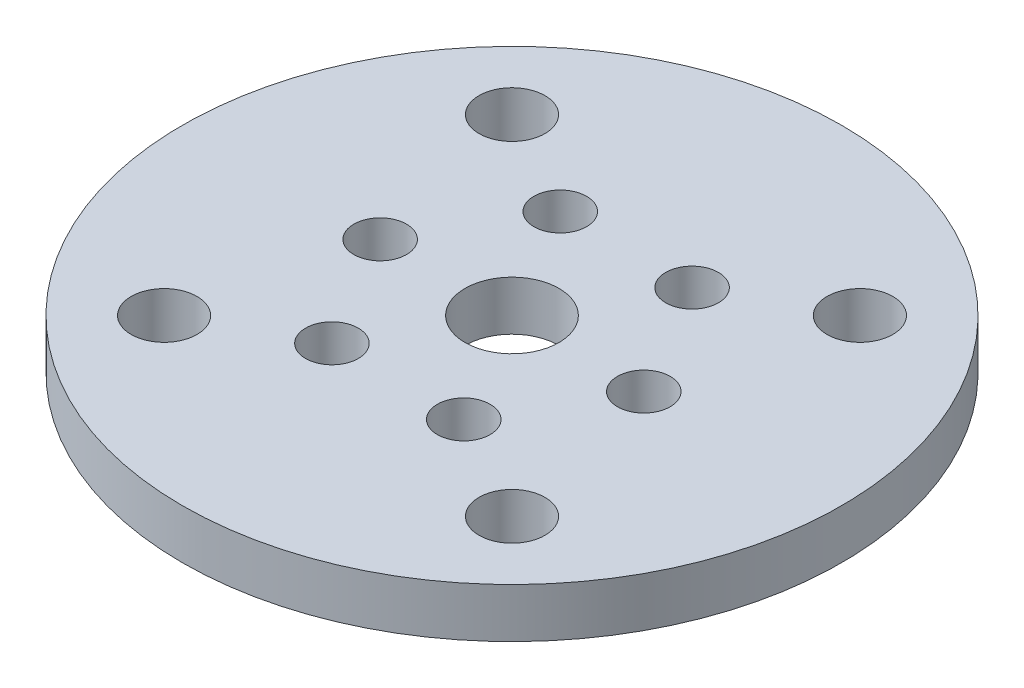
ISO-10303-21;
HEADER;
FILE_DESCRIPTION(('STEP AP214'),'2;1');
FILE_NAME('part.step','',(''),(''),'','','');
FILE_SCHEMA(('AUTOMOTIVE_DESIGN { 1 0 10303 214 1 1 1 1 }'));
ENDSEC;
DATA;
#1=APPLICATION_CONTEXT('core data for automotive mechanical design processes');
#2=APPLICATION_PROTOCOL_DEFINITION('international standard','automotive_design',2000,#1);
#3=PRODUCT_CONTEXT('',#1,'mechanical');
#4=PRODUCT('Part','Part','',(#3));
#5=PRODUCT_RELATED_PRODUCT_CATEGORY('part','',(#4));
#6=PRODUCT_DEFINITION_FORMATION('','',#4);
#7=PRODUCT_DEFINITION_CONTEXT('part definition',#1,'design');
#8=PRODUCT_DEFINITION('design','',#6,#7);
#9=PRODUCT_DEFINITION_SHAPE('','',#8);
#10=(LENGTH_UNIT() NAMED_UNIT(*) SI_UNIT(.MILLI.,.METRE.));
#11=(NAMED_UNIT(*) PLANE_ANGLE_UNIT() SI_UNIT($,.RADIAN.));
#12=(NAMED_UNIT(*) SI_UNIT($,.STERADIAN.) SOLID_ANGLE_UNIT());
#13=UNCERTAINTY_MEASURE_WITH_UNIT(LENGTH_MEASURE(1.E-05),#10,'distance_accuracy_value','');
#14=(GEOMETRIC_REPRESENTATION_CONTEXT(3) GLOBAL_UNCERTAINTY_ASSIGNED_CONTEXT((#13)) GLOBAL_UNIT_ASSIGNED_CONTEXT((#10,
#11,#12)) REPRESENTATION_CONTEXT('',''));
#15=CARTESIAN_POINT('',(0.,0.,0.));
#16=DIRECTION('',(0.,0.,1.));
#17=DIRECTION('',(1.,0.,0.));
#18=AXIS2_PLACEMENT_3D('',#15,#16,#17);
#19=CARTESIAN_POINT('',(0.,0.,0.));
#20=DIRECTION('',(0.,-1.,0.));
#21=DIRECTION('',(0.,0.,-1.));
#22=AXIS2_PLACEMENT_3D('',#19,#20,#21);
#23=CYLINDRICAL_SURFACE('',#22,20.);
#24=CARTESIAN_POINT('',(0.,0.,0.));
#25=DIRECTION('',(0.,-1.,0.));
#26=DIRECTION('',(0.,0.,1.));
#27=AXIS2_PLACEMENT_3D('',#24,#25,#26);
#28=CIRCLE('',#27,20.);
#29=CARTESIAN_POINT('',(0.,0.,20.));
#30=VERTEX_POINT('',#29);
#31=EDGE_CURVE('E10',#30,#30,#28,.T.);
#32=ORIENTED_EDGE('',*,*,#31,.T.);
#33=EDGE_LOOP('',(#32));
#34=FACE_BOUND('',#33,.T.);
#35=CARTESIAN_POINT('',(0.,-3.,0.));
#36=DIRECTION('',(0.,-1.,0.));
#37=DIRECTION('',(0.,0.,1.));
#38=AXIS2_PLACEMENT_3D('',#35,#36,#37);
#39=CIRCLE('',#38,20.);
#40=CARTESIAN_POINT('',(0.,-3.,20.));
#41=VERTEX_POINT('',#40);
#42=EDGE_CURVE('E33',#41,#41,#39,.T.);
#43=ORIENTED_EDGE('',*,*,#42,.F.);
#44=EDGE_LOOP('',(#43));
#45=FACE_BOUND('',#44,.T.);
#46=ADVANCED_FACE('F30',(#34,#45),#23,.T.);
#47=CARTESIAN_POINT('',(0.,0.,0.));
#48=DIRECTION('',(0.,1.,0.));
#49=DIRECTION('',(0.,0.,1.));
#50=AXIS2_PLACEMENT_3D('',#47,#48,#49);
#51=PLANE('',#50);
#52=CARTESIAN_POINT('',(-4.,0.,-6.92820323027552));
#53=DIRECTION('',(0.,-1.,0.));
#54=DIRECTION('',(0.,0.,-1.));
#55=AXIS2_PLACEMENT_3D('',#52,#53,#54);
#56=CIRCLE('',#55,1.6);
#57=CARTESIAN_POINT('',(-4.,0.,-8.52820323027552));
#58=VERTEX_POINT('',#57);
#59=EDGE_CURVE('E99',#58,#58,#56,.T.);
#60=ORIENTED_EDGE('',*,*,#59,.T.);
#61=EDGE_LOOP('',(#60));
#62=FACE_BOUND('',#61,.T.);
#63=CARTESIAN_POINT('',(4.00000000000001,0.,-6.92820323027551));
#64=DIRECTION('',(0.,-1.,0.));
#65=DIRECTION('',(0.,0.,-1.));
#66=AXIS2_PLACEMENT_3D('',#63,#64,#65);
#67=CIRCLE('',#66,1.6);
#68=CARTESIAN_POINT('',(4.00000000000001,0.,-8.52820323027552));
#69=VERTEX_POINT('',#68);
#70=EDGE_CURVE('E93',#69,#69,#67,.T.);
#71=ORIENTED_EDGE('',*,*,#70,.T.);
#72=EDGE_LOOP('',(#71));
#73=FACE_BOUND('',#72,.T.);
#74=CARTESIAN_POINT('',(7.99999999999999,0.,0.));
#75=DIRECTION('',(0.,-1.,0.));
#76=DIRECTION('',(0.,0.,-1.));
#77=AXIS2_PLACEMENT_3D('',#74,#75,#76);
#78=CIRCLE('',#77,1.6);
#79=CARTESIAN_POINT('',(7.99999999999999,0.,-1.6));
#80=VERTEX_POINT('',#79);
#81=EDGE_CURVE('E87',#80,#80,#78,.T.);
#82=ORIENTED_EDGE('',*,*,#81,.T.);
#83=EDGE_LOOP('',(#82));
#84=FACE_BOUND('',#83,.T.);
#85=CARTESIAN_POINT('',(4.,0.,6.92820323027552));
#86=DIRECTION('',(0.,-1.,0.));
#87=DIRECTION('',(0.,0.,-1.));
#88=AXIS2_PLACEMENT_3D('',#85,#86,#87);
#89=CIRCLE('',#88,1.6);
#90=CARTESIAN_POINT('',(4.,0.,5.32820323027552));
#91=VERTEX_POINT('',#90);
#92=EDGE_CURVE('E81',#91,#91,#89,.T.);
#93=ORIENTED_EDGE('',*,*,#92,.T.);
#94=EDGE_LOOP('',(#93));
#95=FACE_BOUND('',#94,.T.);
#96=CARTESIAN_POINT('',(-4.00000000000001,0.,6.92820323027551));
#97=DIRECTION('',(0.,-1.,0.));
#98=DIRECTION('',(0.,0.,-1.));
#99=AXIS2_PLACEMENT_3D('',#96,#97,#98);
#100=CIRCLE('',#99,1.6);
#101=CARTESIAN_POINT('',(-4.00000000000001,0.,5.32820323027551));
#102=VERTEX_POINT('',#101);
#103=EDGE_CURVE('E75',#102,#102,#100,.T.);
#104=ORIENTED_EDGE('',*,*,#103,.T.);
#105=EDGE_LOOP('',(#104));
#106=FACE_BOUND('',#105,.T.);
#107=CARTESIAN_POINT('',(-10.5571042431151,0.,10.5571042431152));
#108=DIRECTION('',(0.,-1.,0.));
#109=DIRECTION('',(0.,0.,1.));
#110=AXIS2_PLACEMENT_3D('',#107,#108,#109);
#111=CIRCLE('',#110,2.);
#112=CARTESIAN_POINT('',(-10.5571042431151,0.,12.5571042431152));
#113=VERTEX_POINT('',#112);
#114=EDGE_CURVE('E69',#113,#113,#111,.T.);
#115=ORIENTED_EDGE('',*,*,#114,.T.);
#116=EDGE_LOOP('',(#115));
#117=FACE_BOUND('',#116,.T.);
#118=CARTESIAN_POINT('',(-10.5571042431152,0.,-10.5571042431151));
#119=DIRECTION('',(0.,-1.,0.));
#120=DIRECTION('',(0.,0.,1.));
#121=AXIS2_PLACEMENT_3D('',#118,#119,#120);
#122=CIRCLE('',#121,2.);
#123=CARTESIAN_POINT('',(-10.5571042431152,0.,-8.55710424311514));
#124=VERTEX_POINT('',#123);
#125=EDGE_CURVE('E63',#124,#124,#122,.T.);
#126=ORIENTED_EDGE('',*,*,#125,.T.);
#127=EDGE_LOOP('',(#126));
#128=FACE_BOUND('',#127,.T.);
#129=CARTESIAN_POINT('',(10.5571042431151,0.,-10.5571042431152));
#130=DIRECTION('',(0.,-1.,0.));
#131=DIRECTION('',(0.,0.,1.));
#132=AXIS2_PLACEMENT_3D('',#129,#130,#131);
#133=CIRCLE('',#132,2.);
#134=CARTESIAN_POINT('',(10.5571042431151,0.,-8.55710424311516));
#135=VERTEX_POINT('',#134);
#136=EDGE_CURVE('E57',#135,#135,#133,.T.);
#137=ORIENTED_EDGE('',*,*,#136,.T.);
#138=EDGE_LOOP('',(#137));
#139=FACE_BOUND('',#138,.T.);
#140=CARTESIAN_POINT('',(-8.00000000000001,0.,0.));
#141=DIRECTION('',(0.,-1.,0.));
#142=DIRECTION('',(0.,0.,-1.));
#143=AXIS2_PLACEMENT_3D('',#140,#141,#142);
#144=CIRCLE('',#143,1.6);
#145=CARTESIAN_POINT('',(-8.00000000000001,0.,-1.6));
#146=VERTEX_POINT('',#145);
#147=EDGE_CURVE('E51',#146,#146,#144,.T.);
#148=ORIENTED_EDGE('',*,*,#147,.T.);
#149=EDGE_LOOP('',(#148));
#150=FACE_BOUND('',#149,.T.);
#151=CARTESIAN_POINT('',(10.5571042431152,0.,10.5571042431151));
#152=DIRECTION('',(0.,-1.,0.));
#153=DIRECTION('',(0.,0.,1.));
#154=AXIS2_PLACEMENT_3D('',#151,#152,#153);
#155=CIRCLE('',#154,2.);
#156=CARTESIAN_POINT('',(10.5571042431152,0.,12.5571042431151));
#157=VERTEX_POINT('',#156);
#158=EDGE_CURVE('E45',#157,#157,#155,.T.);
#159=ORIENTED_EDGE('',*,*,#158,.T.);
#160=EDGE_LOOP('',(#159));
#161=FACE_BOUND('',#160,.T.);
#162=CARTESIAN_POINT('',(0.,0.,0.));
#163=DIRECTION('',(0.,-1.,0.));
#164=DIRECTION('',(0.,0.,1.));
#165=AXIS2_PLACEMENT_3D('',#162,#163,#164);
#166=CIRCLE('',#165,2.85);
#167=CARTESIAN_POINT('',(0.,0.,2.85));
#168=VERTEX_POINT('',#167);
#169=EDGE_CURVE('E40',#168,#168,#166,.T.);
#170=ORIENTED_EDGE('',*,*,#169,.T.);
#171=EDGE_LOOP('',(#170));
#172=FACE_BOUND('',#171,.T.);
#173=ORIENTED_EDGE('',*,*,#31,.F.);
#174=EDGE_LOOP('',(#173));
#175=FACE_BOUND('',#174,.T.);
#176=ADVANCED_FACE('F108',(#62,#73,#84,#95,#106,#117,#128,#139,#150,#161,#172,#175),#51,.T.);
#177=CARTESIAN_POINT('',(0.,-3.,0.));
#178=DIRECTION('',(0.,1.,0.));
#179=DIRECTION('',(0.,0.,1.));
#180=AXIS2_PLACEMENT_3D('',#177,#178,#179);
#181=PLANE('',#180);
#182=CARTESIAN_POINT('',(-4.,-3.,-6.92820323027552));
#183=DIRECTION('',(0.,-1.,0.));
#184=DIRECTION('',(0.,0.,-1.));
#185=AXIS2_PLACEMENT_3D('',#182,#183,#184);
#186=CIRCLE('',#185,1.6);
#187=CARTESIAN_POINT('',(-4.,-3.,-8.52820323027552));
#188=VERTEX_POINT('',#187);
#189=EDGE_CURVE('E102',#188,#188,#186,.T.);
#190=ORIENTED_EDGE('',*,*,#189,.F.);
#191=EDGE_LOOP('',(#190));
#192=FACE_BOUND('',#191,.T.);
#193=CARTESIAN_POINT('',(4.00000000000001,-3.,-6.92820323027551));
#194=DIRECTION('',(0.,-1.,0.));
#195=DIRECTION('',(0.,0.,-1.));
#196=AXIS2_PLACEMENT_3D('',#193,#194,#195);
#197=CIRCLE('',#196,1.6);
#198=CARTESIAN_POINT('',(4.00000000000001,-3.,-8.52820323027552));
#199=VERTEX_POINT('',#198);
#200=EDGE_CURVE('E96',#199,#199,#197,.T.);
#201=ORIENTED_EDGE('',*,*,#200,.F.);
#202=EDGE_LOOP('',(#201));
#203=FACE_BOUND('',#202,.T.);
#204=CARTESIAN_POINT('',(7.99999999999999,-3.,0.));
#205=DIRECTION('',(0.,-1.,0.));
#206=DIRECTION('',(0.,0.,-1.));
#207=AXIS2_PLACEMENT_3D('',#204,#205,#206);
#208=CIRCLE('',#207,1.6);
#209=CARTESIAN_POINT('',(7.99999999999999,-3.,-1.6));
#210=VERTEX_POINT('',#209);
#211=EDGE_CURVE('E90',#210,#210,#208,.T.);
#212=ORIENTED_EDGE('',*,*,#211,.F.);
#213=EDGE_LOOP('',(#212));
#214=FACE_BOUND('',#213,.T.);
#215=CARTESIAN_POINT('',(4.,-3.,6.92820323027552));
#216=DIRECTION('',(0.,-1.,0.));
#217=DIRECTION('',(0.,0.,-1.));
#218=AXIS2_PLACEMENT_3D('',#215,#216,#217);
#219=CIRCLE('',#218,1.6);
#220=CARTESIAN_POINT('',(4.,-3.,5.32820323027552));
#221=VERTEX_POINT('',#220);
#222=EDGE_CURVE('E84',#221,#221,#219,.T.);
#223=ORIENTED_EDGE('',*,*,#222,.F.);
#224=EDGE_LOOP('',(#223));
#225=FACE_BOUND('',#224,.T.);
#226=CARTESIAN_POINT('',(-4.00000000000001,-3.,6.92820323027551));
#227=DIRECTION('',(0.,-1.,0.));
#228=DIRECTION('',(0.,0.,-1.));
#229=AXIS2_PLACEMENT_3D('',#226,#227,#228);
#230=CIRCLE('',#229,1.6);
#231=CARTESIAN_POINT('',(-4.00000000000001,-3.,5.32820323027551));
#232=VERTEX_POINT('',#231);
#233=EDGE_CURVE('E78',#232,#232,#230,.T.);
#234=ORIENTED_EDGE('',*,*,#233,.F.);
#235=EDGE_LOOP('',(#234));
#236=FACE_BOUND('',#235,.T.);
#237=CARTESIAN_POINT('',(-10.5571042431151,-3.,10.5571042431152));
#238=DIRECTION('',(0.,-1.,0.));
#239=DIRECTION('',(0.,0.,1.));
#240=AXIS2_PLACEMENT_3D('',#237,#238,#239);
#241=CIRCLE('',#240,2.);
#242=CARTESIAN_POINT('',(-10.5571042431151,-3.,12.5571042431152));
#243=VERTEX_POINT('',#242);
#244=EDGE_CURVE('E72',#243,#243,#241,.T.);
#245=ORIENTED_EDGE('',*,*,#244,.F.);
#246=EDGE_LOOP('',(#245));
#247=FACE_BOUND('',#246,.T.);
#248=CARTESIAN_POINT('',(-10.5571042431152,-3.,-10.5571042431151));
#249=DIRECTION('',(0.,-1.,0.));
#250=DIRECTION('',(0.,0.,1.));
#251=AXIS2_PLACEMENT_3D('',#248,#249,#250);
#252=CIRCLE('',#251,2.);
#253=CARTESIAN_POINT('',(-10.5571042431152,-3.,-8.55710424311514));
#254=VERTEX_POINT('',#253);
#255=EDGE_CURVE('E66',#254,#254,#252,.T.);
#256=ORIENTED_EDGE('',*,*,#255,.F.);
#257=EDGE_LOOP('',(#256));
#258=FACE_BOUND('',#257,.T.);
#259=CARTESIAN_POINT('',(10.5571042431151,-3.,-10.5571042431152));
#260=DIRECTION('',(0.,-1.,0.));
#261=DIRECTION('',(0.,0.,1.));
#262=AXIS2_PLACEMENT_3D('',#259,#260,#261);
#263=CIRCLE('',#262,2.);
#264=CARTESIAN_POINT('',(10.5571042431151,-3.,-8.55710424311516));
#265=VERTEX_POINT('',#264);
#266=EDGE_CURVE('E60',#265,#265,#263,.T.);
#267=ORIENTED_EDGE('',*,*,#266,.F.);
#268=EDGE_LOOP('',(#267));
#269=FACE_BOUND('',#268,.T.);
#270=CARTESIAN_POINT('',(-8.00000000000001,-3.,0.));
#271=DIRECTION('',(0.,-1.,0.));
#272=DIRECTION('',(0.,0.,-1.));
#273=AXIS2_PLACEMENT_3D('',#270,#271,#272);
#274=CIRCLE('',#273,1.6);
#275=CARTESIAN_POINT('',(-8.00000000000001,-3.,-1.6));
#276=VERTEX_POINT('',#275);
#277=EDGE_CURVE('E54',#276,#276,#274,.T.);
#278=ORIENTED_EDGE('',*,*,#277,.F.);
#279=EDGE_LOOP('',(#278));
#280=FACE_BOUND('',#279,.T.);
#281=CARTESIAN_POINT('',(10.5571042431152,-3.,10.5571042431151));
#282=DIRECTION('',(0.,-1.,0.));
#283=DIRECTION('',(0.,0.,1.));
#284=AXIS2_PLACEMENT_3D('',#281,#282,#283);
#285=CIRCLE('',#284,2.);
#286=CARTESIAN_POINT('',(10.5571042431152,-3.,12.5571042431151));
#287=VERTEX_POINT('',#286);
#288=EDGE_CURVE('E48',#287,#287,#285,.T.);
#289=ORIENTED_EDGE('',*,*,#288,.F.);
#290=EDGE_LOOP('',(#289));
#291=FACE_BOUND('',#290,.T.);
#292=CARTESIAN_POINT('',(0.,-3.,0.));
#293=DIRECTION('',(0.,-1.,0.));
#294=DIRECTION('',(0.,0.,1.));
#295=AXIS2_PLACEMENT_3D('',#292,#293,#294);
#296=CIRCLE('',#295,2.85);
#297=CARTESIAN_POINT('',(0.,-3.,2.85));
#298=VERTEX_POINT('',#297);
#299=EDGE_CURVE('E42',#298,#298,#296,.T.);
#300=ORIENTED_EDGE('',*,*,#299,.F.);
#301=EDGE_LOOP('',(#300));
#302=FACE_BOUND('',#301,.T.);
#303=ORIENTED_EDGE('',*,*,#42,.T.);
#304=EDGE_LOOP('',(#303));
#305=FACE_BOUND('',#304,.T.);
#306=ADVANCED_FACE('F118',(#192,#203,#214,#225,#236,#247,#258,#269,#280,#291,#302,#305),#181,.F.);
#307=CARTESIAN_POINT('',(0.,0.,0.));
#308=DIRECTION('',(0.,-1.,0.));
#309=DIRECTION('',(0.,0.,-1.));
#310=AXIS2_PLACEMENT_3D('',#307,#308,#309);
#311=CYLINDRICAL_SURFACE('',#310,2.85);
#312=ORIENTED_EDGE('',*,*,#169,.F.);
#313=EDGE_LOOP('',(#312));
#314=FACE_BOUND('',#313,.T.);
#315=ORIENTED_EDGE('',*,*,#299,.T.);
#316=EDGE_LOOP('',(#315));
#317=FACE_BOUND('',#316,.T.);
#318=ADVANCED_FACE('F121',(#314,#317),#311,.F.);
#319=CARTESIAN_POINT('',(10.5571042431152,0.,10.5571042431151));
#320=DIRECTION('',(0.,-1.,0.));
#321=DIRECTION('',(0.,0.,-1.));
#322=AXIS2_PLACEMENT_3D('',#319,#320,#321);
#323=CYLINDRICAL_SURFACE('',#322,2.);
#324=ORIENTED_EDGE('',*,*,#158,.F.);
#325=EDGE_LOOP('',(#324));
#326=FACE_BOUND('',#325,.T.);
#327=ORIENTED_EDGE('',*,*,#288,.T.);
#328=EDGE_LOOP('',(#327));
#329=FACE_BOUND('',#328,.T.);
#330=ADVANCED_FACE('F154',(#326,#329),#323,.F.);
#331=CARTESIAN_POINT('',(-8.00000000000001,0.,0.));
#332=DIRECTION('',(0.,-1.,0.));
#333=DIRECTION('',(0.,0.,-1.));
#334=AXIS2_PLACEMENT_3D('',#331,#332,#333);
#335=CYLINDRICAL_SURFACE('',#334,1.6);
#336=ORIENTED_EDGE('',*,*,#147,.F.);
#337=EDGE_LOOP('',(#336));
#338=FACE_BOUND('',#337,.T.);
#339=ORIENTED_EDGE('',*,*,#277,.T.);
#340=EDGE_LOOP('',(#339));
#341=FACE_BOUND('',#340,.T.);
#342=ADVANCED_FACE('F158',(#338,#341),#335,.F.);
#343=CARTESIAN_POINT('',(10.5571042431151,0.,-10.5571042431152));
#344=DIRECTION('',(0.,-1.,0.));
#345=DIRECTION('',(0.,0.,-1.));
#346=AXIS2_PLACEMENT_3D('',#343,#344,#345);
#347=CYLINDRICAL_SURFACE('',#346,2.);
#348=ORIENTED_EDGE('',*,*,#136,.F.);
#349=EDGE_LOOP('',(#348));
#350=FACE_BOUND('',#349,.T.);
#351=ORIENTED_EDGE('',*,*,#266,.T.);
#352=EDGE_LOOP('',(#351));
#353=FACE_BOUND('',#352,.T.);
#354=ADVANCED_FACE('F162',(#350,#353),#347,.F.);
#355=CARTESIAN_POINT('',(-10.5571042431152,0.,-10.5571042431151));
#356=DIRECTION('',(0.,-1.,0.));
#357=DIRECTION('',(0.,0.,-1.));
#358=AXIS2_PLACEMENT_3D('',#355,#356,#357);
#359=CYLINDRICAL_SURFACE('',#358,2.);
#360=ORIENTED_EDGE('',*,*,#125,.F.);
#361=EDGE_LOOP('',(#360));
#362=FACE_BOUND('',#361,.T.);
#363=ORIENTED_EDGE('',*,*,#255,.T.);
#364=EDGE_LOOP('',(#363));
#365=FACE_BOUND('',#364,.T.);
#366=ADVANCED_FACE('F166',(#362,#365),#359,.F.);
#367=CARTESIAN_POINT('',(-10.5571042431151,0.,10.5571042431152));
#368=DIRECTION('',(0.,-1.,0.));
#369=DIRECTION('',(0.,0.,-1.));
#370=AXIS2_PLACEMENT_3D('',#367,#368,#369);
#371=CYLINDRICAL_SURFACE('',#370,2.);
#372=ORIENTED_EDGE('',*,*,#114,.F.);
#373=EDGE_LOOP('',(#372));
#374=FACE_BOUND('',#373,.T.);
#375=ORIENTED_EDGE('',*,*,#244,.T.);
#376=EDGE_LOOP('',(#375));
#377=FACE_BOUND('',#376,.T.);
#378=ADVANCED_FACE('F170',(#374,#377),#371,.F.);
#379=CARTESIAN_POINT('',(-4.00000000000001,0.,6.92820323027551));
#380=DIRECTION('',(0.,-1.,0.));
#381=DIRECTION('',(0.,0.,-1.));
#382=AXIS2_PLACEMENT_3D('',#379,#380,#381);
#383=CYLINDRICAL_SURFACE('',#382,1.6);
#384=ORIENTED_EDGE('',*,*,#103,.F.);
#385=EDGE_LOOP('',(#384));
#386=FACE_BOUND('',#385,.T.);
#387=ORIENTED_EDGE('',*,*,#233,.T.);
#388=EDGE_LOOP('',(#387));
#389=FACE_BOUND('',#388,.T.);
#390=ADVANCED_FACE('F174',(#386,#389),#383,.F.);
#391=CARTESIAN_POINT('',(4.,0.,6.92820323027552));
#392=DIRECTION('',(0.,-1.,0.));
#393=DIRECTION('',(0.,0.,-1.));
#394=AXIS2_PLACEMENT_3D('',#391,#392,#393);
#395=CYLINDRICAL_SURFACE('',#394,1.6);
#396=ORIENTED_EDGE('',*,*,#92,.F.);
#397=EDGE_LOOP('',(#396));
#398=FACE_BOUND('',#397,.T.);
#399=ORIENTED_EDGE('',*,*,#222,.T.);
#400=EDGE_LOOP('',(#399));
#401=FACE_BOUND('',#400,.T.);
#402=ADVANCED_FACE('F178',(#398,#401),#395,.F.);
#403=CARTESIAN_POINT('',(7.99999999999999,0.,0.));
#404=DIRECTION('',(0.,-1.,0.));
#405=DIRECTION('',(0.,0.,-1.));
#406=AXIS2_PLACEMENT_3D('',#403,#404,#405);
#407=CYLINDRICAL_SURFACE('',#406,1.6);
#408=ORIENTED_EDGE('',*,*,#81,.F.);
#409=EDGE_LOOP('',(#408));
#410=FACE_BOUND('',#409,.T.);
#411=ORIENTED_EDGE('',*,*,#211,.T.);
#412=EDGE_LOOP('',(#411));
#413=FACE_BOUND('',#412,.T.);
#414=ADVANCED_FACE('F182',(#410,#413),#407,.F.);
#415=CARTESIAN_POINT('',(4.00000000000001,0.,-6.92820323027551));
#416=DIRECTION('',(0.,-1.,0.));
#417=DIRECTION('',(0.,0.,-1.));
#418=AXIS2_PLACEMENT_3D('',#415,#416,#417);
#419=CYLINDRICAL_SURFACE('',#418,1.6);
#420=ORIENTED_EDGE('',*,*,#70,.F.);
#421=EDGE_LOOP('',(#420));
#422=FACE_BOUND('',#421,.T.);
#423=ORIENTED_EDGE('',*,*,#200,.T.);
#424=EDGE_LOOP('',(#423));
#425=FACE_BOUND('',#424,.T.);
#426=ADVANCED_FACE('F114',(#422,#425),#419,.F.);
#427=CARTESIAN_POINT('',(-4.,0.,-6.92820323027552));
#428=DIRECTION('',(0.,-1.,0.));
#429=DIRECTION('',(0.,0.,-1.));
#430=AXIS2_PLACEMENT_3D('',#427,#428,#429);
#431=CYLINDRICAL_SURFACE('',#430,1.6);
#432=ORIENTED_EDGE('',*,*,#59,.F.);
#433=EDGE_LOOP('',(#432));
#434=FACE_BOUND('',#433,.T.);
#435=ORIENTED_EDGE('',*,*,#189,.T.);
#436=EDGE_LOOP('',(#435));
#437=FACE_BOUND('',#436,.T.);
#438=ADVANCED_FACE('F111',(#434,#437),#431,.F.);
#439=CLOSED_SHELL('',(#46,#176,#306,#318,#330,#342,#354,#366,#378,#390,#402,#414,#426,#438));
#440=MANIFOLD_SOLID_BREP('B2',#439);
#441=ADVANCED_BREP_SHAPE_REPRESENTATION('',(#18,#440),#14);
#442=SHAPE_DEFINITION_REPRESENTATION(#9,#441);
ENDSEC;
END-ISO-10303-21;
